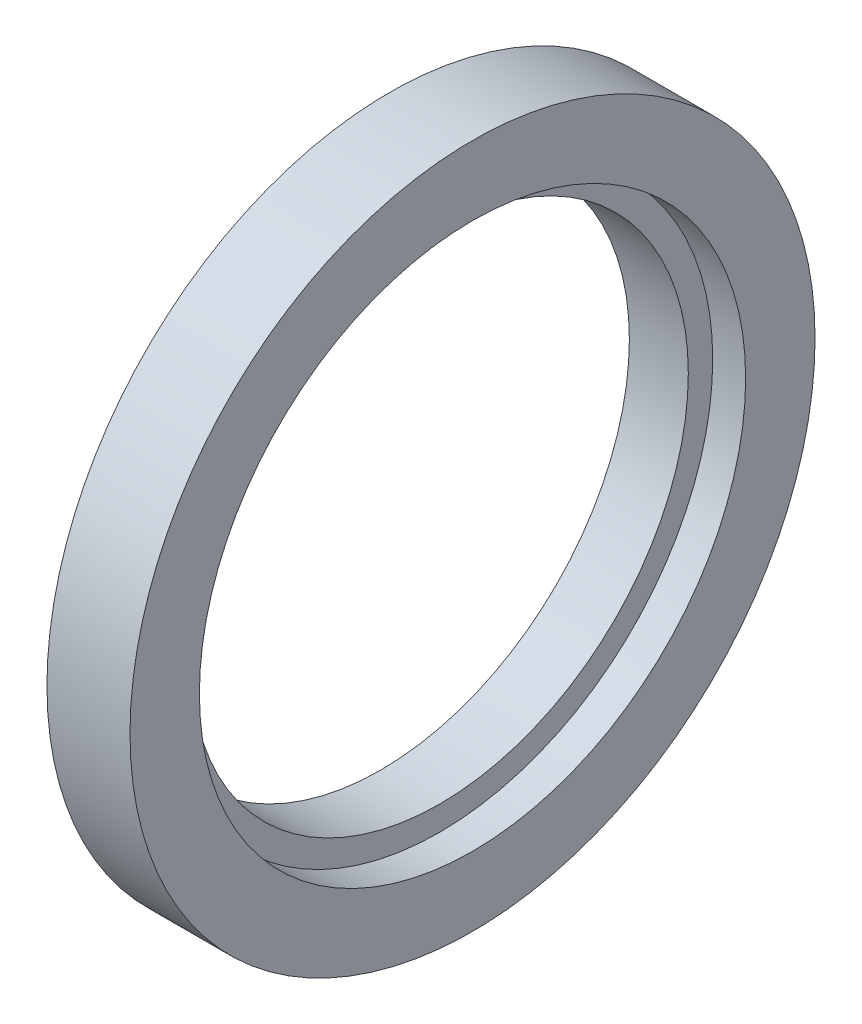
ISO-10303-21;
HEADER;
FILE_DESCRIPTION(('STEP AP214'),'2;1');
FILE_NAME('part.step','',(''),(''),'','','');
FILE_SCHEMA(('AUTOMOTIVE_DESIGN { 1 0 10303 214 1 1 1 1 }'));
ENDSEC;
DATA;
#1=APPLICATION_CONTEXT('core data for automotive mechanical design processes');
#2=APPLICATION_PROTOCOL_DEFINITION('international standard','automotive_design',2000,#1);
#3=PRODUCT_CONTEXT('',#1,'mechanical');
#4=PRODUCT('Part','Part','',(#3));
#5=PRODUCT_RELATED_PRODUCT_CATEGORY('part','',(#4));
#6=PRODUCT_DEFINITION_FORMATION('','',#4);
#7=PRODUCT_DEFINITION_CONTEXT('part definition',#1,'design');
#8=PRODUCT_DEFINITION('design','',#6,#7);
#9=PRODUCT_DEFINITION_SHAPE('','',#8);
#10=(LENGTH_UNIT() NAMED_UNIT(*) SI_UNIT(.MILLI.,.METRE.));
#11=(NAMED_UNIT(*) PLANE_ANGLE_UNIT() SI_UNIT($,.RADIAN.));
#12=(NAMED_UNIT(*) SI_UNIT($,.STERADIAN.) SOLID_ANGLE_UNIT());
#13=UNCERTAINTY_MEASURE_WITH_UNIT(LENGTH_MEASURE(1.E-05),#10,'distance_accuracy_value','');
#14=(GEOMETRIC_REPRESENTATION_CONTEXT(3) GLOBAL_UNCERTAINTY_ASSIGNED_CONTEXT((#13)) GLOBAL_UNIT_ASSIGNED_CONTEXT((#10,
#11,#12)) REPRESENTATION_CONTEXT('',''));
#15=CARTESIAN_POINT('',(0.,0.,0.));
#16=DIRECTION('',(0.,0.,1.));
#17=DIRECTION('',(1.,0.,0.));
#18=AXIS2_PLACEMENT_3D('',#15,#16,#17);
#19=CARTESIAN_POINT('',(2.0692999999999,0.,0.));
#20=DIRECTION('',(1.,0.,0.));
#21=DIRECTION('',(0.,0.,-1.));
#22=AXIS2_PLACEMENT_3D('',#19,#20,#21);
#23=CYLINDRICAL_SURFACE('',#22,17.4624999999999);
#24=CARTESIAN_POINT('',(4.13859999999983,0.,0.));
#25=DIRECTION('',(1.,0.,0.));
#26=DIRECTION('',(0.,0.,-1.));
#27=AXIS2_PLACEMENT_3D('',#24,#25,#26);
#28=CIRCLE('',#27,17.4624999999999);
#29=CARTESIAN_POINT('',(4.13859999999983,0.,-17.4624999999999));
#30=VERTEX_POINT('',#29);
#31=EDGE_CURVE('E17',#30,#30,#28,.F.);
#32=ORIENTED_EDGE('',*,*,#31,.F.);
#33=EDGE_LOOP('',(#32));
#34=FACE_BOUND('',#33,.T.);
#35=CARTESIAN_POINT('',(0.,0.,0.));
#36=DIRECTION('',(1.,0.,0.));
#37=DIRECTION('',(0.,0.,-1.));
#38=AXIS2_PLACEMENT_3D('',#35,#36,#37);
#39=CIRCLE('',#38,17.4624999999999);
#40=CARTESIAN_POINT('',(0.,0.,-17.4624999999999));
#41=VERTEX_POINT('',#40);
#42=EDGE_CURVE('E43',#41,#41,#39,.T.);
#43=ORIENTED_EDGE('',*,*,#42,.F.);
#44=EDGE_LOOP('',(#43));
#45=FACE_BOUND('',#44,.T.);
#46=ADVANCED_FACE('F14',(#34,#45),#23,.F.);
#47=CARTESIAN_POINT('',(4.13859999999983,18.3197499999999,0.));
#48=DIRECTION('',(1.,0.,0.));
#49=DIRECTION('',(0.,0.,-1.));
#50=AXIS2_PLACEMENT_3D('',#47,#48,#49);
#51=PLANE('',#50);
#52=ORIENTED_EDGE('',*,*,#31,.T.);
#53=EDGE_LOOP('',(#52));
#54=FACE_BOUND('',#53,.T.);
#55=CARTESIAN_POINT('',(4.13859999999983,0.,0.));
#56=DIRECTION('',(1.,0.,0.));
#57=DIRECTION('',(0.,0.,-1.));
#58=AXIS2_PLACEMENT_3D('',#55,#56,#57);
#59=CIRCLE('',#58,19.1769999999999);
#60=CARTESIAN_POINT('',(4.13859999999983,0.,-19.1769999999999));
#61=VERTEX_POINT('',#60);
#62=EDGE_CURVE('E41',#61,#61,#59,.T.);
#63=ORIENTED_EDGE('',*,*,#62,.T.);
#64=EDGE_LOOP('',(#63));
#65=FACE_BOUND('',#64,.T.);
#66=ADVANCED_FACE('F50',(#54,#65),#51,.T.);
#67=CARTESIAN_POINT('',(0.,19.2062500000005,0.));
#68=DIRECTION('',(-1.,0.,0.));
#69=DIRECTION('',(0.,0.,1.));
#70=AXIS2_PLACEMENT_3D('',#67,#68,#69);
#71=PLANE('',#70);
#72=ORIENTED_EDGE('',*,*,#42,.T.);
#73=EDGE_LOOP('',(#72));
#74=FACE_BOUND('',#73,.T.);
#75=CARTESIAN_POINT('',(0.,0.,0.));
#76=DIRECTION('',(1.,0.,0.));
#77=DIRECTION('',(0.,0.,-1.));
#78=AXIS2_PLACEMENT_3D('',#75,#76,#77);
#79=CIRCLE('',#78,20.950000000001);
#80=CARTESIAN_POINT('',(0.,0.,-20.950000000001));
#81=VERTEX_POINT('',#80);
#82=EDGE_CURVE('E38',#81,#81,#79,.F.);
#83=ORIENTED_EDGE('',*,*,#82,.T.);
#84=EDGE_LOOP('',(#83));
#85=FACE_BOUND('',#84,.T.);
#86=ADVANCED_FACE('F59',(#74,#85),#71,.T.);
#87=CARTESIAN_POINT('',(5.29429999999922,0.,0.));
#88=DIRECTION('',(1.,0.,0.));
#89=DIRECTION('',(0.,0.,-1.));
#90=AXIS2_PLACEMENT_3D('',#87,#88,#89);
#91=CYLINDRICAL_SURFACE('',#90,19.1769999999999);
#92=CARTESIAN_POINT('',(6.44999999999861,0.,0.));
#93=DIRECTION('',(1.,0.,0.));
#94=DIRECTION('',(0.,0.,-1.));
#95=AXIS2_PLACEMENT_3D('',#92,#93,#94);
#96=CIRCLE('',#95,19.1769999999999);
#97=CARTESIAN_POINT('',(6.44999999999861,0.,-19.1769999999999));
#98=VERTEX_POINT('',#97);
#99=EDGE_CURVE('E33',#98,#98,#96,.F.);
#100=ORIENTED_EDGE('',*,*,#99,.F.);
#101=EDGE_LOOP('',(#100));
#102=FACE_BOUND('',#101,.T.);
#103=ORIENTED_EDGE('',*,*,#62,.F.);
#104=EDGE_LOOP('',(#103));
#105=FACE_BOUND('',#104,.T.);
#106=ADVANCED_FACE('F78',(#102,#105),#91,.F.);
#107=CARTESIAN_POINT('',(-0.255000000000098,0.,0.));
#108=DIRECTION('',(1.,0.,0.));
#109=DIRECTION('',(0.,0.,-1.));
#110=AXIS2_PLACEMENT_3D('',#107,#108,#109);
#111=CYLINDRICAL_SURFACE('',#110,20.950000000001);
#112=ORIENTED_EDGE('',*,*,#82,.F.);
#113=EDGE_LOOP('',(#112));
#114=FACE_BOUND('',#113,.T.);
#115=CARTESIAN_POINT('',(-0.510000002164026,0.,0.));
#116=DIRECTION('',(1.,0.,0.));
#117=DIRECTION('',(0.,1.,0.));
#118=AXIS2_PLACEMENT_3D('',#115,#116,#117);
#119=CIRCLE('',#118,20.9500000007886);
#120=CARTESIAN_POINT('',(-0.510000002164026,20.9500000007886,0.));
#121=VERTEX_POINT('',#120);
#122=EDGE_CURVE('E26',#121,#121,#119,.T.);
#123=ORIENTED_EDGE('',*,*,#122,.F.);
#124=EDGE_LOOP('',(#123));
#125=FACE_BOUND('',#124,.T.);
#126=ADVANCED_FACE('F74',(#114,#125),#111,.F.);
#127=CARTESIAN_POINT('',(6.44999999999861,21.6135000000001,0.));
#128=DIRECTION('',(1.,0.,0.));
#129=DIRECTION('',(0.,0.,-1.));
#130=AXIS2_PLACEMENT_3D('',#127,#128,#129);
#131=PLANE('',#130);
#132=ORIENTED_EDGE('',*,*,#99,.T.);
#133=EDGE_LOOP('',(#132));
#134=FACE_BOUND('',#133,.T.);
#135=CARTESIAN_POINT('',(6.44999999999861,0.,0.));
#136=DIRECTION('',(1.,0.,0.));
#137=DIRECTION('',(0.,0.,-1.));
#138=AXIS2_PLACEMENT_3D('',#135,#136,#137);
#139=CIRCLE('',#138,24.0500000000003);
#140=CARTESIAN_POINT('',(6.44999999999861,0.,-24.0500000000003));
#141=VERTEX_POINT('',#140);
#142=EDGE_CURVE('E21',#141,#141,#139,.F.);
#143=ORIENTED_EDGE('',*,*,#142,.F.);
#144=EDGE_LOOP('',(#143));
#145=FACE_BOUND('',#144,.T.);
#146=ADVANCED_FACE('F67',(#134,#145),#131,.T.);
#147=CARTESIAN_POINT('',(0.618307728388946,0.,0.));
#148=DIRECTION('',(1.,0.,0.));
#149=DIRECTION('',(0.,0.,-1.));
#150=AXIS2_PLACEMENT_3D('',#147,#148,#149);
#151=CONICAL_SURFACE('',#150,24.0499999992128,1.22173047499991);
#152=ORIENTED_EDGE('',*,*,#122,.T.);
#153=EDGE_LOOP('',(#152));
#154=FACE_BOUND('',#153,.T.);
#155=CARTESIAN_POINT('',(0.618307726225102,0.,0.));
#156=DIRECTION('',(1.,0.,0.));
#157=DIRECTION('',(0.,0.,-1.));
#158=AXIS2_PLACEMENT_3D('',#155,#156,#157);
#159=CIRCLE('',#158,24.0500000000003);
#160=CARTESIAN_POINT('',(0.618307726225102,0.,-24.0500000000003));
#161=VERTEX_POINT('',#160);
#162=EDGE_CURVE('E9',#161,#161,#159,.T.);
#163=ORIENTED_EDGE('',*,*,#162,.F.);
#164=EDGE_LOOP('',(#163));
#165=FACE_BOUND('',#164,.T.);
#166=ADVANCED_FACE('F62',(#154,#165),#151,.T.);
#167=CARTESIAN_POINT('',(3.53415386311184,0.,0.));
#168=DIRECTION('',(1.,0.,0.));
#169=DIRECTION('',(0.,0.,-1.));
#170=AXIS2_PLACEMENT_3D('',#167,#168,#169);
#171=CYLINDRICAL_SURFACE('',#170,24.0500000000003);
#172=ORIENTED_EDGE('',*,*,#162,.T.);
#173=EDGE_LOOP('',(#172));
#174=FACE_BOUND('',#173,.T.);
#175=ORIENTED_EDGE('',*,*,#142,.T.);
#176=EDGE_LOOP('',(#175));
#177=FACE_BOUND('',#176,.T.);
#178=ADVANCED_FACE('F60',(#174,#177),#171,.T.);
#179=CLOSED_SHELL('',(#46,#66,#86,#106,#126,#146,#166,#178));
#180=MANIFOLD_SOLID_BREP('B1',#179);
#181=ADVANCED_BREP_SHAPE_REPRESENTATION('',(#18,#180),#14);
#182=SHAPE_DEFINITION_REPRESENTATION(#9,#181);
ENDSEC;
END-ISO-10303-21;
